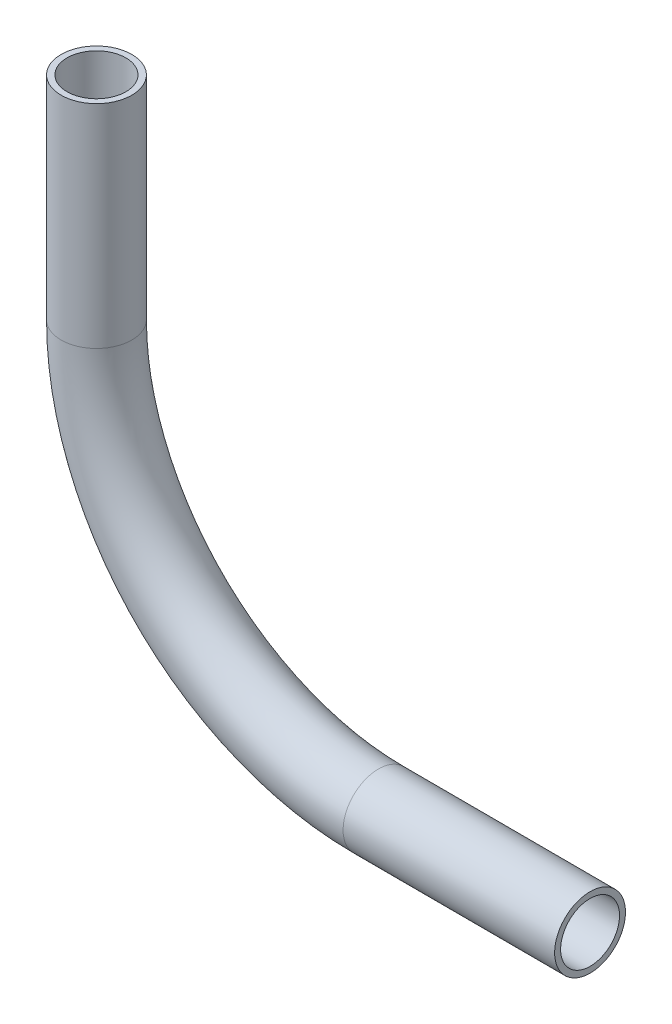
ISO-10303-21;
HEADER;
FILE_DESCRIPTION(('STEP AP214'),'2;1');
FILE_NAME('part.step','',(''),(''),'','','');
FILE_SCHEMA(('AUTOMOTIVE_DESIGN { 1 0 10303 214 1 1 1 1 }'));
ENDSEC;
DATA;
#1=APPLICATION_CONTEXT('core data for automotive mechanical design processes');
#2=APPLICATION_PROTOCOL_DEFINITION('international standard','automotive_design',2000,#1);
#3=PRODUCT_CONTEXT('',#1,'mechanical');
#4=PRODUCT('Part','Part','',(#3));
#5=PRODUCT_RELATED_PRODUCT_CATEGORY('part','',(#4));
#6=PRODUCT_DEFINITION_FORMATION('','',#4);
#7=PRODUCT_DEFINITION_CONTEXT('part definition',#1,'design');
#8=PRODUCT_DEFINITION('design','',#6,#7);
#9=PRODUCT_DEFINITION_SHAPE('','',#8);
#10=(LENGTH_UNIT() NAMED_UNIT(*) SI_UNIT(.MILLI.,.METRE.));
#11=(NAMED_UNIT(*) PLANE_ANGLE_UNIT() SI_UNIT($,.RADIAN.));
#12=(NAMED_UNIT(*) SI_UNIT($,.STERADIAN.) SOLID_ANGLE_UNIT());
#13=UNCERTAINTY_MEASURE_WITH_UNIT(LENGTH_MEASURE(1.E-05),#10,'distance_accuracy_value','');
#14=(GEOMETRIC_REPRESENTATION_CONTEXT(3) GLOBAL_UNCERTAINTY_ASSIGNED_CONTEXT((#13)) GLOBAL_UNIT_ASSIGNED_CONTEXT((#10,
#11,#12)) REPRESENTATION_CONTEXT('',''));
#15=CARTESIAN_POINT('',(0.,0.,0.));
#16=DIRECTION('',(0.,0.,1.));
#17=DIRECTION('',(1.,0.,0.));
#18=AXIS2_PLACEMENT_3D('',#15,#16,#17);
#19=CARTESIAN_POINT('',(44.5241187807455,-661.216394340681,354.927728694173));
#20=DIRECTION('',(0.,1.,0.));
#21=DIRECTION('',(0.,0.,1.));
#22=AXIS2_PLACEMENT_3D('',#19,#20,#21);
#23=CYLINDRICAL_SURFACE('',#22,5.2832);
#24=CARTESIAN_POINT('',(44.5241187807455,-623.116394340681,354.927728694173));
#25=DIRECTION('',(0.,-1.,0.));
#26=DIRECTION('',(0.,0.,-1.));
#27=AXIS2_PLACEMENT_3D('',#24,#25,#26);
#28=CIRCLE('',#27,5.2832);
#29=CARTESIAN_POINT('',(44.5241187807455,-623.116394340681,349.644528694173));
#30=VERTEX_POINT('',#29);
#31=EDGE_CURVE('E54',#30,#30,#28,.T.);
#32=ORIENTED_EDGE('',*,*,#31,.F.);
#33=EDGE_LOOP('',(#32));
#34=FACE_BOUND('',#33,.T.);
#35=CARTESIAN_POINT('',(44.5241187807457,-661.216394340681,354.927728694173));
#36=DIRECTION('',(0.,1.,0.));
#37=DIRECTION('',(0.,0.,1.));
#38=AXIS2_PLACEMENT_3D('',#35,#36,#37);
#39=CIRCLE('',#38,5.2832);
#40=CARTESIAN_POINT('',(39.2409333496049,-661.216394340681,354.915321430902));
#41=VERTEX_POINT('',#40);
#42=EDGE_CURVE('E65',#41,#41,#39,.T.);
#43=ORIENTED_EDGE('',*,*,#42,.F.);
#44=EDGE_LOOP('',(#43));
#45=FACE_BOUND('',#44,.T.);
#46=ADVANCED_FACE('F47',(#34,#45),#23,.F.);
#47=CARTESIAN_POINT('',(44.5241187807455,-661.216394340681,354.927728694173));
#48=DIRECTION('',(0.,1.,0.));
#49=DIRECTION('',(0.,0.,1.));
#50=AXIS2_PLACEMENT_3D('',#47,#48,#49);
#51=CYLINDRICAL_SURFACE('',#50,6.35);
#52=CARTESIAN_POINT('',(44.5241187807455,-623.116394340681,354.927728694173));
#53=DIRECTION('',(0.,-1.,0.));
#54=DIRECTION('',(0.,0.,-1.));
#55=AXIS2_PLACEMENT_3D('',#52,#53,#54);
#56=CIRCLE('',#55,6.35);
#57=CARTESIAN_POINT('',(44.5241187807455,-623.116394340681,348.577728694173));
#58=VERTEX_POINT('',#57);
#59=EDGE_CURVE('E58',#58,#58,#56,.T.);
#60=ORIENTED_EDGE('',*,*,#59,.T.);
#61=EDGE_LOOP('',(#60));
#62=FACE_BOUND('',#61,.T.);
#63=CARTESIAN_POINT('',(44.5241187807455,-661.216394340681,354.927728694173));
#64=DIRECTION('',(0.,-1.,0.));
#65=DIRECTION('',(0.,0.,-1.));
#66=AXIS2_PLACEMENT_3D('',#63,#64,#65);
#67=CIRCLE('',#66,6.35);
#68=CARTESIAN_POINT('',(38.1741362913938,-661.216394340681,354.912816118126));
#69=VERTEX_POINT('',#68);
#70=EDGE_CURVE('E13',#69,#69,#67,.T.);
#71=ORIENTED_EDGE('',*,*,#70,.F.);
#72=EDGE_LOOP('',(#71));
#73=FACE_BOUND('',#72,.T.);
#74=ADVANCED_FACE('F49',(#62,#73),#51,.T.);
#75=CARTESIAN_POINT('',(44.5241187807455,-623.116394340681,354.927728694173));
#76=DIRECTION('',(0.,-1.,0.));
#77=DIRECTION('',(0.,0.,-1.));
#78=AXIS2_PLACEMENT_3D('',#75,#76,#77);
#79=PLANE('',#78);
#80=ORIENTED_EDGE('',*,*,#31,.T.);
#81=EDGE_LOOP('',(#80));
#82=FACE_BOUND('',#81,.T.);
#83=ORIENTED_EDGE('',*,*,#59,.F.);
#84=EDGE_LOOP('',(#83));
#85=FACE_BOUND('',#84,.T.);
#86=ADVANCED_FACE('F99',(#82,#85),#79,.F.);
#87=CARTESIAN_POINT('',(95.3239786955607,-661.216394340681,355.047029302544));
#88=DIRECTION('',(0.00234843717266914,0.,-0.999997242417621));
#89=DIRECTION('',(-0.999997242417621,0.,-0.00234843717266914));
#90=AXIS2_PLACEMENT_3D('',#87,#88,#89);
#91=TOROIDAL_SURFACE('',#90,50.7999999999998,5.2832);
#92=CARTESIAN_POINT('',(95.3239786955607,-712.016394340681,355.047029302544));
#93=DIRECTION('',(-0.999997242417621,0.,-0.00234843717266709));
#94=DIRECTION('',(-0.00234843717266709,0.,0.999997242417621));
#95=AXIS2_PLACEMENT_3D('',#92,#93,#94);
#96=CIRCLE('',#95,5.2832);
#97=CARTESIAN_POINT('',(95.3239786955607,-717.299594340681,355.047029302544));
#98=VERTEX_POINT('',#97);
#99=EDGE_CURVE('E71',#98,#98,#96,.T.);
#100=CARTESIAN_POINT('',(95.3239786955607,-661.216394340681,355.047029302544));
#101=DIRECTION('',(0.00234843717266914,0.,-0.999997242417621));
#102=DIRECTION('',(-0.999997242417621,0.,-0.00234843717266914));
#103=AXIS2_PLACEMENT_3D('',#100,#101,#102);
#104=CIRCLE('',#103,56.0831999999998);
#105=EDGE_CURVE('',#98,#41,#104,.T.);
#106=ORIENTED_EDGE('',*,*,#99,.F.);
#107=ORIENTED_EDGE('',*,*,#42,.T.);
#108=ORIENTED_EDGE('',*,*,#105,.T.);
#109=ORIENTED_EDGE('',*,*,#105,.F.);
#110=EDGE_LOOP('',(#106,#108,#107,#109));
#111=FACE_BOUND('',#110,.T.);
#112=ADVANCED_FACE('F91',(#111),#91,.F.);
#113=CARTESIAN_POINT('',(95.3239786955607,-661.216394340681,355.047029302544));
#114=DIRECTION('',(0.00234843717266914,0.,-0.999997242417621));
#115=DIRECTION('',(-0.999997242417621,0.,-0.00234843717266914));
#116=AXIS2_PLACEMENT_3D('',#113,#114,#115);
#117=TOROIDAL_SURFACE('',#116,50.7999999999998,6.35);
#118=CARTESIAN_POINT('',(95.3239786955607,-712.016394340681,355.047029302544));
#119=DIRECTION('',(0.999997242417621,0.,0.00234843717266764));
#120=DIRECTION('',(0.00234843717266764,0.,-0.999997242417621));
#121=AXIS2_PLACEMENT_3D('',#118,#119,#120);
#122=CIRCLE('',#121,6.35);
#123=CARTESIAN_POINT('',(95.3239786955607,-718.366394340681,355.047029302544));
#124=VERTEX_POINT('',#123);
#125=EDGE_CURVE('E62',#124,#124,#122,.T.);
#126=CARTESIAN_POINT('',(95.3239786955607,-661.216394340681,355.047029302544));
#127=DIRECTION('',(0.00234843717266914,0.,-0.999997242417621));
#128=DIRECTION('',(-0.999997242417621,0.,-0.00234843717266914));
#129=AXIS2_PLACEMENT_3D('',#126,#127,#128);
#130=CIRCLE('',#129,57.1499999999998);
#131=EDGE_CURVE('',#124,#69,#130,.T.);
#132=ORIENTED_EDGE('',*,*,#125,.F.);
#133=ORIENTED_EDGE('',*,*,#70,.T.);
#134=ORIENTED_EDGE('',*,*,#131,.T.);
#135=ORIENTED_EDGE('',*,*,#131,.F.);
#136=EDGE_LOOP('',(#132,#134,#133,#135));
#137=FACE_BOUND('',#136,.T.);
#138=ADVANCED_FACE('F89',(#137),#117,.T.);
#139=CARTESIAN_POINT('',(133.423873631672,-712.016394340681,355.136504758823));
#140=DIRECTION('',(-0.999997242417621,0.,-0.00234843717267187));
#141=DIRECTION('',(-0.00234843717267187,0.,0.999997242417621));
#142=AXIS2_PLACEMENT_3D('',#139,#140,#141);
#143=CYLINDRICAL_SURFACE('',#142,5.2832);
#144=CARTESIAN_POINT('',(133.423873631672,-712.016394340681,355.136504758823));
#145=DIRECTION('',(0.999997242417621,0.,0.00234843717266709));
#146=DIRECTION('',(0.00234843069665813,-0.00234843717266859,-0.999994484842846));
#147=AXIS2_PLACEMENT_3D('',#144,#145,#146);
#148=CIRCLE('',#147,5.2832);
#149=CARTESIAN_POINT('',(133.436280860729,-712.028801603952,349.853333896501));
#150=VERTEX_POINT('',#149);
#151=EDGE_CURVE('E74',#150,#150,#148,.T.);
#152=ORIENTED_EDGE('',*,*,#151,.T.);
#153=EDGE_LOOP('',(#152));
#154=FACE_BOUND('',#153,.T.);
#155=ORIENTED_EDGE('',*,*,#99,.T.);
#156=EDGE_LOOP('',(#155));
#157=FACE_BOUND('',#156,.T.);
#158=ADVANCED_FACE('F85',(#154,#157),#143,.F.);
#159=CARTESIAN_POINT('',(133.423873631672,-712.016394340681,355.136504758823));
#160=DIRECTION('',(-0.999997242417621,0.,-0.00234843717267187));
#161=DIRECTION('',(-0.00234843717267187,0.,0.999997242417621));
#162=AXIS2_PLACEMENT_3D('',#159,#160,#161);
#163=CYLINDRICAL_SURFACE('',#162,6.35);
#164=CARTESIAN_POINT('',(133.423873631672,-712.016394340681,355.136504758823));
#165=DIRECTION('',(0.999997242417621,0.,0.00234843717266709));
#166=DIRECTION('',(0.00234843069665813,-0.00234843717266859,-0.999994484842846));
#167=AXIS2_PLACEMENT_3D('',#164,#165,#166);
#168=CIRCLE('',#167,6.35);
#169=CARTESIAN_POINT('',(133.438786166596,-712.031306916728,348.786539780071));
#170=VERTEX_POINT('',#169);
#171=EDGE_CURVE('E68',#170,#170,#168,.T.);
#172=ORIENTED_EDGE('',*,*,#171,.F.);
#173=EDGE_LOOP('',(#172));
#174=FACE_BOUND('',#173,.T.);
#175=ORIENTED_EDGE('',*,*,#125,.T.);
#176=EDGE_LOOP('',(#175));
#177=FACE_BOUND('',#176,.T.);
#178=ADVANCED_FACE('F82',(#174,#177),#163,.T.);
#179=CARTESIAN_POINT('',(133.423873631672,-712.016394340681,355.136504758823));
#180=DIRECTION('',(0.999997242417621,0.,0.00234843717266709));
#181=DIRECTION('',(0.00234843069665813,-0.00234843717266859,-0.999994484842846));
#182=AXIS2_PLACEMENT_3D('',#179,#180,#181);
#183=PLANE('',#182);
#184=ORIENTED_EDGE('',*,*,#151,.F.);
#185=EDGE_LOOP('',(#184));
#186=FACE_BOUND('',#185,.T.);
#187=ORIENTED_EDGE('',*,*,#171,.T.);
#188=EDGE_LOOP('',(#187));
#189=FACE_BOUND('',#188,.T.);
#190=ADVANCED_FACE('F80',(#186,#189),#183,.T.);
#191=CLOSED_SHELL('',(#46,#74,#86,#112,#138,#158,#178,#190));
#192=MANIFOLD_SOLID_BREP('B2',#191);
#193=ADVANCED_BREP_SHAPE_REPRESENTATION('',(#18,#192),#14);
#194=SHAPE_DEFINITION_REPRESENTATION(#9,#193);
ENDSEC;
END-ISO-10303-21;
